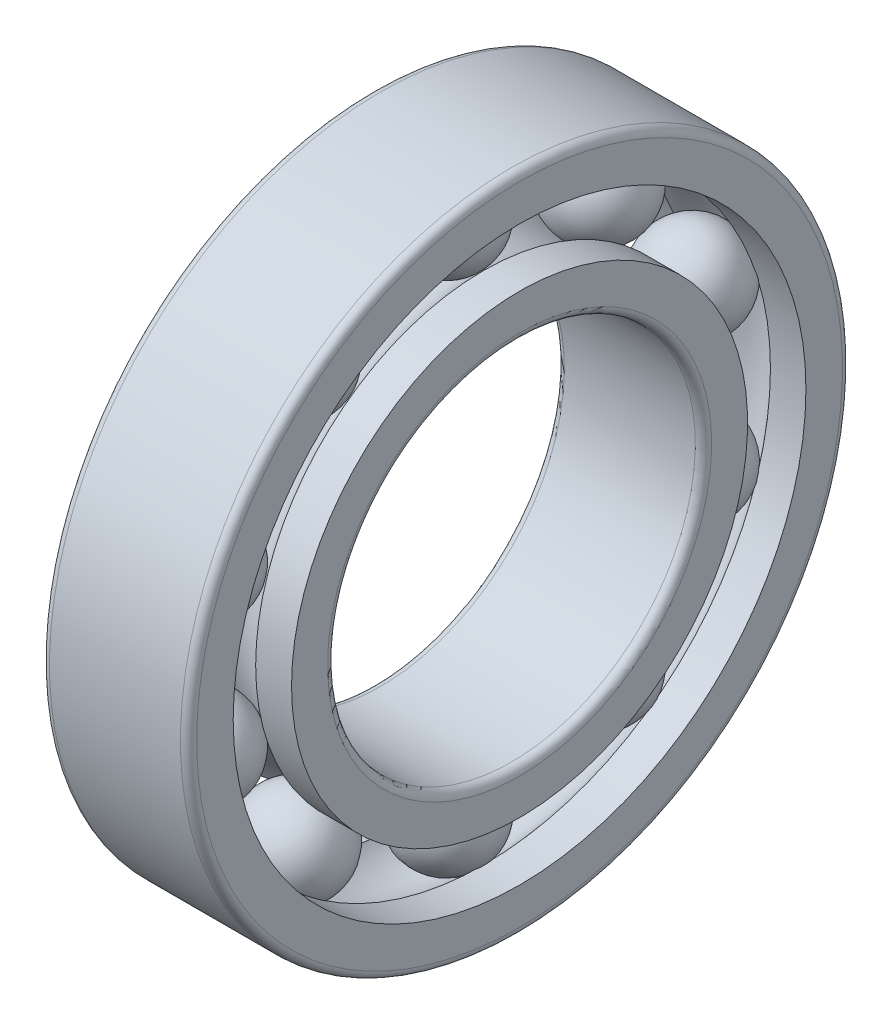
ISO-10303-21;
HEADER;
FILE_DESCRIPTION(('STEP AP214'),'2;1');
FILE_NAME('part.step','',(''),(''),'','','');
FILE_SCHEMA(('AUTOMOTIVE_DESIGN { 1 0 10303 214 1 1 1 1 }'));
ENDSEC;
DATA;
#1=APPLICATION_CONTEXT('core data for automotive mechanical design processes');
#2=APPLICATION_PROTOCOL_DEFINITION('international standard','automotive_design',2000,#1);
#3=PRODUCT_CONTEXT('',#1,'mechanical');
#4=PRODUCT('Part','Part','',(#3));
#5=PRODUCT_RELATED_PRODUCT_CATEGORY('part','',(#4));
#6=PRODUCT_DEFINITION_FORMATION('','',#4);
#7=PRODUCT_DEFINITION_CONTEXT('part definition',#1,'design');
#8=PRODUCT_DEFINITION('design','',#6,#7);
#9=PRODUCT_DEFINITION_SHAPE('','',#8);
#10=(LENGTH_UNIT() NAMED_UNIT(*) SI_UNIT(.MILLI.,.METRE.));
#11=(NAMED_UNIT(*) PLANE_ANGLE_UNIT() SI_UNIT($,.RADIAN.));
#12=(NAMED_UNIT(*) SI_UNIT($,.STERADIAN.) SOLID_ANGLE_UNIT());
#13=UNCERTAINTY_MEASURE_WITH_UNIT(LENGTH_MEASURE(1.E-05),#10,'distance_accuracy_value','');
#14=(GEOMETRIC_REPRESENTATION_CONTEXT(3) GLOBAL_UNCERTAINTY_ASSIGNED_CONTEXT((#13)) GLOBAL_UNIT_ASSIGNED_CONTEXT((#10,
#11,#12)) REPRESENTATION_CONTEXT('',''));
#15=CARTESIAN_POINT('',(0.,0.,0.));
#16=DIRECTION('',(0.,0.,1.));
#17=DIRECTION('',(1.,0.,0.));
#18=AXIS2_PLACEMENT_3D('',#15,#16,#17);
#19=CARTESIAN_POINT('',(10.,-10.8650375222232,-33.4391471129376));
#20=DIRECTION('',(0.689414425900797,0.536271774771845,0.486950031258784));
#21=DIRECTION('',(0.407744625601292,-0.842926175682675,0.351026754880939));
#22=AXIS2_PLACEMENT_3D('',#19,#20,#21);
#23=SPHERICAL_SURFACE('',#22,6.5);
#24=CARTESIAN_POINT('',(5.51880623164482,-14.3508040582402,-36.6043223161197));
#25=VERTEX_POINT('',#24);
#26=VERTEX_LOOP('',#25);
#27=FACE_BOUND('',#26,.T.);
#28=CARTESIAN_POINT('',(14.4811937683552,-7.37927098620621,-30.2739719097555));
#29=VERTEX_POINT('',#28);
#30=VERTEX_LOOP('',#29);
#31=FACE_BOUND('',#30,.T.);
#32=ADVANCED_FACE('P0_F16',(#27,#31),#23,.T.);
#33=CLOSED_SHELL('',(#32));
#34=MANIFOLD_SOLID_BREP('P0_B1',#33);
#35=CARTESIAN_POINT('',(10.,-28.4450375222232,-20.6665294706034));
#36=DIRECTION('',(0.0861185466508673,0.817785264653347,0.569043809243716));
#37=DIRECTION('',(-0.21949427876557,-0.541558086898072,0.811502988352158));
#38=AXIS2_PLACEMENT_3D('',#35,#36,#37);
#39=SPHERICAL_SURFACE('',#38,6.5);
#40=CARTESIAN_POINT('',(10.5597705532306,-23.1294333019764,-16.9677447105192));
#41=VERTEX_POINT('',#40);
#42=VERTEX_LOOP('',#41);
#43=FACE_BOUND('',#42,.T.);
#44=CARTESIAN_POINT('',(9.44022944676936,-33.76064174247,-24.3653142306876));
#45=VERTEX_POINT('',#44);
#46=VERTEX_LOOP('',#45);
#47=FACE_BOUND('',#46,.T.);
#48=ADVANCED_FACE('P1_F16',(#43,#47),#39,.T.);
#49=CLOSED_SHELL('',(#48));
#50=MANIFOLD_SOLID_BREP('P1_B1',#49);
#51=CARTESIAN_POINT('',(10.,-35.16,0.));
#52=DIRECTION('',(0.0861185466508673,0.817785264653347,0.569043809243716));
#53=DIRECTION('',(-0.21949427876557,-0.541558086898072,0.811502988352158));
#54=AXIS2_PLACEMENT_3D('',#51,#52,#53);
#55=SPHERICAL_SURFACE('',#54,6.5);
#56=CARTESIAN_POINT('',(9.44022944676936,-40.4756042202468,-3.69878476008415));
#57=VERTEX_POINT('',#56);
#58=VERTEX_LOOP('',#57);
#59=FACE_BOUND('',#58,.T.);
#60=CARTESIAN_POINT('',(10.5597705532306,-29.8443957797532,3.69878476008415));
#61=VERTEX_POINT('',#60);
#62=VERTEX_LOOP('',#61);
#63=FACE_BOUND('',#62,.T.);
#64=ADVANCED_FACE('P2_F16',(#59,#63),#55,.T.);
#65=CLOSED_SHELL('',(#64));
#66=MANIFOLD_SOLID_BREP('P2_B1',#65);
#67=CARTESIAN_POINT('',(10.,-28.4450375222231,20.6665294706034));
#68=DIRECTION('',(0.0861185466508673,0.817785264653347,0.569043809243716));
#69=DIRECTION('',(-0.21949427876557,-0.541558086898072,0.811502988352158));
#70=AXIS2_PLACEMENT_3D('',#67,#68,#69);
#71=SPHERICAL_SURFACE('',#70,6.5);
#72=CARTESIAN_POINT('',(9.44022944676936,-33.7606417424699,16.9677447105192));
#73=VERTEX_POINT('',#72);
#74=VERTEX_LOOP('',#73);
#75=FACE_BOUND('',#74,.T.);
#76=CARTESIAN_POINT('',(10.5597705532306,-23.1294333019763,24.3653142306876));
#77=VERTEX_POINT('',#76);
#78=VERTEX_LOOP('',#77);
#79=FACE_BOUND('',#78,.T.);
#80=ADVANCED_FACE('P3_F15',(#75,#79),#71,.T.);
#81=CLOSED_SHELL('',(#80));
#82=MANIFOLD_SOLID_BREP('P3_B1',#81);
#83=CARTESIAN_POINT('',(10.,-10.8650375222231,33.4391471129376));
#84=DIRECTION('',(0.0861185466508673,0.817785264653347,0.569043809243716));
#85=DIRECTION('',(-0.21949427876557,-0.541558086898072,0.811502988352158));
#86=AXIS2_PLACEMENT_3D('',#83,#84,#85);
#87=SPHERICAL_SURFACE('',#86,6.5);
#88=CARTESIAN_POINT('',(9.44022944676936,-16.1806417424699,29.7403623528534));
#89=VERTEX_POINT('',#88);
#90=VERTEX_LOOP('',#89);
#91=FACE_BOUND('',#90,.T.);
#92=CARTESIAN_POINT('',(10.5597705532306,-5.54943330197634,37.1379318730217));
#93=VERTEX_POINT('',#92);
#94=VERTEX_LOOP('',#93);
#95=FACE_BOUND('',#94,.T.);
#96=ADVANCED_FACE('P4_F16',(#91,#95),#87,.T.);
#97=CLOSED_SHELL('',(#96));
#98=MANIFOLD_SOLID_BREP('P4_B1',#97);
#99=CARTESIAN_POINT('',(10.,10.8650375222232,33.4391471129376));
#100=DIRECTION('',(0.0861185466508673,0.817785264653347,0.569043809243716));
#101=DIRECTION('',(-0.21949427876557,-0.541558086898072,0.811502988352158));
#102=AXIS2_PLACEMENT_3D('',#99,#100,#101);
#103=SPHERICAL_SURFACE('',#102,6.5);
#104=CARTESIAN_POINT('',(9.44022944676936,5.54943330197645,29.7403623528534));
#105=VERTEX_POINT('',#104);
#106=VERTEX_LOOP('',#105);
#107=FACE_BOUND('',#106,.T.);
#108=CARTESIAN_POINT('',(10.5597705532306,16.18064174247,37.1379318730217));
#109=VERTEX_POINT('',#108);
#110=VERTEX_LOOP('',#109);
#111=FACE_BOUND('',#110,.T.);
#112=ADVANCED_FACE('P5_F16',(#107,#111),#103,.T.);
#113=CLOSED_SHELL('',(#112));
#114=MANIFOLD_SOLID_BREP('P5_B1',#113);
#115=CARTESIAN_POINT('',(10.,28.4450375222231,20.6665294706034));
#116=DIRECTION('',(0.0861185466508673,0.817785264653347,0.569043809243716));
#117=DIRECTION('',(-0.21949427876557,-0.541558086898072,0.811502988352158));
#118=AXIS2_PLACEMENT_3D('',#115,#116,#117);
#119=SPHERICAL_SURFACE('',#118,6.5);
#120=CARTESIAN_POINT('',(9.44022944676936,23.1294333019763,16.9677447105192));
#121=VERTEX_POINT('',#120);
#122=VERTEX_LOOP('',#121);
#123=FACE_BOUND('',#122,.T.);
#124=CARTESIAN_POINT('',(10.5597705532306,33.7606417424699,24.3653142306876));
#125=VERTEX_POINT('',#124);
#126=VERTEX_LOOP('',#125);
#127=FACE_BOUND('',#126,.T.);
#128=ADVANCED_FACE('P6_F16',(#123,#127),#119,.T.);
#129=CLOSED_SHELL('',(#128));
#130=MANIFOLD_SOLID_BREP('P6_B1',#129);
#131=CARTESIAN_POINT('',(10.,35.16,0.));
#132=DIRECTION('',(0.0861185466508673,0.817785264653347,0.569043809243716));
#133=DIRECTION('',(-0.21949427876557,-0.541558086898072,0.811502988352158));
#134=AXIS2_PLACEMENT_3D('',#131,#132,#133);
#135=SPHERICAL_SURFACE('',#134,6.5);
#136=CARTESIAN_POINT('',(10.5597705532306,40.4756042202468,3.69878476008415));
#137=VERTEX_POINT('',#136);
#138=VERTEX_LOOP('',#137);
#139=FACE_BOUND('',#138,.T.);
#140=CARTESIAN_POINT('',(9.44022944676936,29.8443957797532,-3.69878476008415));
#141=VERTEX_POINT('',#140);
#142=VERTEX_LOOP('',#141);
#143=FACE_BOUND('',#142,.T.);
#144=ADVANCED_FACE('P7_F16',(#139,#143),#135,.T.);
#145=CLOSED_SHELL('',(#144));
#146=MANIFOLD_SOLID_BREP('P7_B1',#145);
#147=CARTESIAN_POINT('',(10.,0.,0.));
#148=DIRECTION('',(-1.,0.,0.));
#149=DIRECTION('',(0.,0.,1.));
#150=AXIS2_PLACEMENT_3D('',#147,#148,#149);
#151=CYLINDRICAL_SURFACE('',#150,45.);
#152=CARTESIAN_POINT('',(1.1,0.,0.));
#153=DIRECTION('',(1.,0.,0.));
#154=DIRECTION('',(0.,1.,0.));
#155=AXIS2_PLACEMENT_3D('',#152,#153,#154);
#156=CIRCLE('',#155,45.);
#157=CARTESIAN_POINT('',(1.1,45.,0.));
#158=VERTEX_POINT('',#157);
#159=EDGE_CURVE('P8_E77',#158,#158,#156,.F.);
#160=ORIENTED_EDGE('',*,*,#159,.F.);
#161=EDGE_LOOP('',(#160));
#162=FACE_BOUND('',#161,.T.);
#163=CARTESIAN_POINT('',(18.9,0.,0.));
#164=DIRECTION('',(1.,0.,0.));
#165=DIRECTION('',(0.,1.,0.));
#166=AXIS2_PLACEMENT_3D('',#163,#164,#165);
#167=CIRCLE('',#166,45.);
#168=CARTESIAN_POINT('',(18.9,45.,0.));
#169=VERTEX_POINT('',#168);
#170=EDGE_CURVE('P8_E73',#169,#169,#167,.T.);
#171=ORIENTED_EDGE('',*,*,#170,.F.);
#172=EDGE_LOOP('',(#171));
#173=FACE_BOUND('',#172,.T.);
#174=ADVANCED_FACE('P8_F15',(#162,#173),#151,.T.);
#175=CARTESIAN_POINT('',(1.1,0.,0.));
#176=DIRECTION('',(1.,0.,0.));
#177=DIRECTION('',(0.,1.,0.));
#178=AXIS2_PLACEMENT_3D('',#175,#176,#177);
#179=TOROIDAL_SURFACE('',#178,43.9,1.1);
#180=CARTESIAN_POINT('',(0.,0.,0.));
#181=DIRECTION('',(1.,0.,0.));
#182=DIRECTION('',(0.,-1.,0.));
#183=AXIS2_PLACEMENT_3D('',#180,#181,#182);
#184=CIRCLE('',#183,43.9);
#185=CARTESIAN_POINT('',(0.,-43.9,0.));
#186=VERTEX_POINT('',#185);
#187=EDGE_CURVE('P8_E76',#186,#186,#184,.F.);
#188=ORIENTED_EDGE('',*,*,#187,.F.);
#189=EDGE_LOOP('',(#188));
#190=FACE_BOUND('',#189,.T.);
#191=ORIENTED_EDGE('',*,*,#159,.T.);
#192=EDGE_LOOP('',(#191));
#193=FACE_BOUND('',#192,.T.);
#194=ADVANCED_FACE('P8_F91',(#190,#193),#179,.T.);
#195=CARTESIAN_POINT('',(18.9,0.,0.));
#196=DIRECTION('',(1.,0.,0.));
#197=DIRECTION('',(0.,1.,0.));
#198=AXIS2_PLACEMENT_3D('',#195,#196,#197);
#199=TOROIDAL_SURFACE('',#198,43.9,1.1);
#200=ORIENTED_EDGE('',*,*,#170,.T.);
#201=EDGE_LOOP('',(#200));
#202=FACE_BOUND('',#201,.T.);
#203=CARTESIAN_POINT('',(20.,0.,0.));
#204=DIRECTION('',(-1.,0.,0.));
#205=DIRECTION('',(0.,-1.,0.));
#206=AXIS2_PLACEMENT_3D('',#203,#204,#205);
#207=CIRCLE('',#206,43.9);
#208=CARTESIAN_POINT('',(20.,-43.9,0.));
#209=VERTEX_POINT('',#208);
#210=EDGE_CURVE('P8_E36',#209,#209,#207,.F.);
#211=ORIENTED_EDGE('',*,*,#210,.F.);
#212=EDGE_LOOP('',(#211));
#213=FACE_BOUND('',#212,.T.);
#214=ADVANCED_FACE('P8_F60',(#202,#213),#199,.T.);
#215=CARTESIAN_POINT('',(0.,0.,41.41500025));
#216=DIRECTION('',(-1.,0.,0.));
#217=DIRECTION('',(0.,0.,1.));
#218=AXIS2_PLACEMENT_3D('',#215,#216,#217);
#219=PLANE('',#218);
#220=CARTESIAN_POINT('',(0.,0.,0.));
#221=DIRECTION('',(-1.,0.,0.));
#222=DIRECTION('',(0.,0.,1.));
#223=AXIS2_PLACEMENT_3D('',#220,#221,#222);
#224=CIRCLE('',#223,38.9300005);
#225=CARTESIAN_POINT('',(0.,0.,38.9300005));
#226=VERTEX_POINT('',#225);
#227=EDGE_CURVE('P8_E18',#226,#226,#224,.F.);
#228=ORIENTED_EDGE('',*,*,#227,.T.);
#229=EDGE_LOOP('',(#228));
#230=FACE_BOUND('',#229,.T.);
#231=ORIENTED_EDGE('',*,*,#187,.T.);
#232=EDGE_LOOP('',(#231));
#233=FACE_BOUND('',#232,.T.);
#234=ADVANCED_FACE('P8_F54',(#230,#233),#219,.T.);
#235=CARTESIAN_POINT('',(20.,0.,41.41500025));
#236=DIRECTION('',(1.,0.,0.));
#237=DIRECTION('',(0.,0.,-1.));
#238=AXIS2_PLACEMENT_3D('',#235,#236,#237);
#239=PLANE('',#238);
#240=CARTESIAN_POINT('',(20.,0.,0.));
#241=DIRECTION('',(-1.,0.,0.));
#242=DIRECTION('',(0.,0.,1.));
#243=AXIS2_PLACEMENT_3D('',#240,#241,#242);
#244=CIRCLE('',#243,38.9300005);
#245=CARTESIAN_POINT('',(20.,0.,38.9300005));
#246=VERTEX_POINT('',#245);
#247=EDGE_CURVE('P8_E27',#246,#246,#244,.T.);
#248=ORIENTED_EDGE('',*,*,#247,.T.);
#249=EDGE_LOOP('',(#248));
#250=FACE_BOUND('',#249,.T.);
#251=ORIENTED_EDGE('',*,*,#210,.T.);
#252=EDGE_LOOP('',(#251));
#253=FACE_BOUND('',#252,.T.);
#254=ADVANCED_FACE('P8_F43',(#250,#253),#239,.T.);
#255=CARTESIAN_POINT('',(2.41131809263866,0.,0.));
#256=DIRECTION('',(-1.,0.,0.));
#257=DIRECTION('',(0.,0.,1.));
#258=AXIS2_PLACEMENT_3D('',#255,#256,#257);
#259=CYLINDRICAL_SURFACE('',#258,38.9300005);
#260=CARTESIAN_POINT('',(4.82263618527732,0.,0.));
#261=DIRECTION('',(1.,0.,0.));
#262=DIRECTION('',(0.,1.,0.));
#263=AXIS2_PLACEMENT_3D('',#260,#261,#262);
#264=CIRCLE('',#263,38.9300005);
#265=CARTESIAN_POINT('',(4.82263618527732,38.9300005,0.));
#266=VERTEX_POINT('',#265);
#267=EDGE_CURVE('P8_E22',#266,#266,#264,.T.);
#268=ORIENTED_EDGE('',*,*,#267,.T.);
#269=EDGE_LOOP('',(#268));
#270=FACE_BOUND('',#269,.T.);
#271=ORIENTED_EDGE('',*,*,#227,.F.);
#272=EDGE_LOOP('',(#271));
#273=FACE_BOUND('',#272,.T.);
#274=ADVANCED_FACE('P8_F53',(#270,#273),#259,.F.);
#275=CARTESIAN_POINT('',(17.5886819073613,0.,0.));
#276=DIRECTION('',(-1.,0.,0.));
#277=DIRECTION('',(0.,0.,1.));
#278=AXIS2_PLACEMENT_3D('',#275,#276,#277);
#279=CYLINDRICAL_SURFACE('',#278,38.9300005);
#280=CARTESIAN_POINT('',(15.1773638147227,0.,0.));
#281=DIRECTION('',(1.,0.,0.));
#282=DIRECTION('',(0.,1.,0.));
#283=AXIS2_PLACEMENT_3D('',#280,#281,#282);
#284=CIRCLE('',#283,38.9300005);
#285=CARTESIAN_POINT('',(15.1773638147227,38.9300005,0.));
#286=VERTEX_POINT('',#285);
#287=EDGE_CURVE('P8_E10',#286,#286,#284,.F.);
#288=ORIENTED_EDGE('',*,*,#287,.T.);
#289=EDGE_LOOP('',(#288));
#290=FACE_BOUND('',#289,.T.);
#291=ORIENTED_EDGE('',*,*,#247,.F.);
#292=EDGE_LOOP('',(#291));
#293=FACE_BOUND('',#292,.T.);
#294=ADVANCED_FACE('P8_F123',(#290,#293),#279,.F.);
#295=CARTESIAN_POINT('',(10.,0.,0.));
#296=DIRECTION('',(1.,0.,0.));
#297=DIRECTION('',(0.,1.,0.));
#298=AXIS2_PLACEMENT_3D('',#295,#296,#297);
#299=TOROIDAL_SURFACE('',#298,35.,6.5);
#300=ORIENTED_EDGE('',*,*,#287,.F.);
#301=EDGE_LOOP('',(#300));
#302=FACE_BOUND('',#301,.T.);
#303=ORIENTED_EDGE('',*,*,#267,.F.);
#304=EDGE_LOOP('',(#303));
#305=FACE_BOUND('',#304,.T.);
#306=ADVANCED_FACE('P8_F121',(#302,#305),#299,.F.);
#307=CLOSED_SHELL('',(#174,#194,#214,#234,#254,#274,#294,#306));
#308=MANIFOLD_SOLID_BREP('P8_B1',#307);
#309=CARTESIAN_POINT('',(10.,0.,0.));
#310=DIRECTION('',(-1.,0.,0.));
#311=DIRECTION('',(0.,0.,1.));
#312=AXIS2_PLACEMENT_3D('',#309,#310,#311);
#313=CYLINDRICAL_SURFACE('',#312,25.);
#314=CARTESIAN_POINT('',(1.1,0.,0.));
#315=DIRECTION('',(1.,0.,0.));
#316=DIRECTION('',(0.,1.,0.));
#317=AXIS2_PLACEMENT_3D('',#314,#315,#316);
#318=CIRCLE('',#317,25.);
#319=CARTESIAN_POINT('',(1.1,25.,0.));
#320=VERTEX_POINT('',#319);
#321=EDGE_CURVE('P9_E69',#320,#320,#318,.T.);
#322=ORIENTED_EDGE('',*,*,#321,.F.);
#323=EDGE_LOOP('',(#322));
#324=FACE_BOUND('',#323,.T.);
#325=CARTESIAN_POINT('',(18.9,0.,0.));
#326=DIRECTION('',(1.,0.,0.));
#327=DIRECTION('',(0.,1.,0.));
#328=AXIS2_PLACEMENT_3D('',#325,#326,#327);
#329=CIRCLE('',#328,25.);
#330=CARTESIAN_POINT('',(18.9,25.,0.));
#331=VERTEX_POINT('',#330);
#332=EDGE_CURVE('P9_E66',#331,#331,#329,.F.);
#333=ORIENTED_EDGE('',*,*,#332,.F.);
#334=EDGE_LOOP('',(#333));
#335=FACE_BOUND('',#334,.T.);
#336=ADVANCED_FACE('P9_F15',(#324,#335),#313,.F.);
#337=CARTESIAN_POINT('',(1.1,0.,0.));
#338=DIRECTION('',(1.,0.,0.));
#339=DIRECTION('',(0.,1.,0.));
#340=AXIS2_PLACEMENT_3D('',#337,#338,#339);
#341=TOROIDAL_SURFACE('',#340,26.1,1.1);
#342=ORIENTED_EDGE('',*,*,#321,.T.);
#343=EDGE_LOOP('',(#342));
#344=FACE_BOUND('',#343,.T.);
#345=CARTESIAN_POINT('',(0.,0.,0.));
#346=DIRECTION('',(-1.,0.,0.));
#347=DIRECTION('',(0.,-1.,0.));
#348=AXIS2_PLACEMENT_3D('',#345,#346,#347);
#349=CIRCLE('',#348,26.1);
#350=CARTESIAN_POINT('',(0.,-26.1,0.));
#351=VERTEX_POINT('',#350);
#352=EDGE_CURVE('P9_E39',#351,#351,#349,.F.);
#353=ORIENTED_EDGE('',*,*,#352,.F.);
#354=EDGE_LOOP('',(#353));
#355=FACE_BOUND('',#354,.T.);
#356=ADVANCED_FACE('P9_F59',(#344,#355),#341,.T.);
#357=CARTESIAN_POINT('',(18.9,0.,0.));
#358=DIRECTION('',(1.,0.,0.));
#359=DIRECTION('',(0.,1.,0.));
#360=AXIS2_PLACEMENT_3D('',#357,#358,#359);
#361=TOROIDAL_SURFACE('',#360,26.1,1.1);
#362=CARTESIAN_POINT('',(20.,0.,0.));
#363=DIRECTION('',(1.,0.,0.));
#364=DIRECTION('',(0.,-1.,0.));
#365=AXIS2_PLACEMENT_3D('',#362,#363,#364);
#366=CIRCLE('',#365,26.1);
#367=CARTESIAN_POINT('',(20.,-26.1,0.));
#368=VERTEX_POINT('',#367);
#369=EDGE_CURVE('P9_E72',#368,#368,#366,.F.);
#370=ORIENTED_EDGE('',*,*,#369,.F.);
#371=EDGE_LOOP('',(#370));
#372=FACE_BOUND('',#371,.T.);
#373=ORIENTED_EDGE('',*,*,#332,.T.);
#374=EDGE_LOOP('',(#373));
#375=FACE_BOUND('',#374,.T.);
#376=ADVANCED_FACE('P9_F54',(#372,#375),#361,.T.);
#377=CARTESIAN_POINT('',(0.,0.,28.55));
#378=DIRECTION('',(-1.,0.,0.));
#379=DIRECTION('',(0.,0.,1.));
#380=AXIS2_PLACEMENT_3D('',#377,#378,#379);
#381=PLANE('',#380);
#382=ORIENTED_EDGE('',*,*,#352,.T.);
#383=EDGE_LOOP('',(#382));
#384=FACE_BOUND('',#383,.T.);
#385=CARTESIAN_POINT('',(0.,0.,0.));
#386=DIRECTION('',(-1.,0.,0.));
#387=DIRECTION('',(0.,0.,1.));
#388=AXIS2_PLACEMENT_3D('',#385,#386,#387);
#389=CIRCLE('',#388,31.);
#390=CARTESIAN_POINT('',(0.,0.,31.));
#391=VERTEX_POINT('',#390);
#392=EDGE_CURVE('P9_E18',#391,#391,#389,.F.);
#393=ORIENTED_EDGE('',*,*,#392,.F.);
#394=EDGE_LOOP('',(#393));
#395=FACE_BOUND('',#394,.T.);
#396=ADVANCED_FACE('P9_F44',(#384,#395),#381,.T.);
#397=CARTESIAN_POINT('',(20.,0.,28.55));
#398=DIRECTION('',(1.,0.,0.));
#399=DIRECTION('',(0.,0.,-1.));
#400=AXIS2_PLACEMENT_3D('',#397,#398,#399);
#401=PLANE('',#400);
#402=ORIENTED_EDGE('',*,*,#369,.T.);
#403=EDGE_LOOP('',(#402));
#404=FACE_BOUND('',#403,.T.);
#405=CARTESIAN_POINT('',(20.,0.,0.));
#406=DIRECTION('',(-1.,0.,0.));
#407=DIRECTION('',(0.,0.,1.));
#408=AXIS2_PLACEMENT_3D('',#405,#406,#407);
#409=CIRCLE('',#408,31.);
#410=CARTESIAN_POINT('',(20.,0.,31.));
#411=VERTEX_POINT('',#410);
#412=EDGE_CURVE('P9_E27',#411,#411,#409,.T.);
#413=ORIENTED_EDGE('',*,*,#412,.F.);
#414=EDGE_LOOP('',(#413));
#415=FACE_BOUND('',#414,.T.);
#416=ADVANCED_FACE('P9_F53',(#404,#415),#401,.T.);
#417=CARTESIAN_POINT('',(2.4382623085101,0.,0.));
#418=DIRECTION('',(-1.,0.,0.));
#419=DIRECTION('',(0.,0.,1.));
#420=AXIS2_PLACEMENT_3D('',#417,#418,#419);
#421=CYLINDRICAL_SURFACE('',#420,31.);
#422=ORIENTED_EDGE('',*,*,#392,.T.);
#423=EDGE_LOOP('',(#422));
#424=FACE_BOUND('',#423,.T.);
#425=CARTESIAN_POINT('',(4.8765246170202,0.,0.));
#426=DIRECTION('',(1.,0.,0.));
#427=DIRECTION('',(0.,1.,0.));
#428=AXIS2_PLACEMENT_3D('',#425,#426,#427);
#429=CIRCLE('',#428,31.);
#430=CARTESIAN_POINT('',(4.8765246170202,31.,0.));
#431=VERTEX_POINT('',#430);
#432=EDGE_CURVE('P9_E22',#431,#431,#429,.F.);
#433=ORIENTED_EDGE('',*,*,#432,.T.);
#434=EDGE_LOOP('',(#433));
#435=FACE_BOUND('',#434,.T.);
#436=ADVANCED_FACE('P9_F110',(#424,#435),#421,.T.);
#437=CARTESIAN_POINT('',(17.5617376914899,0.,0.));
#438=DIRECTION('',(-1.,0.,0.));
#439=DIRECTION('',(0.,0.,1.));
#440=AXIS2_PLACEMENT_3D('',#437,#438,#439);
#441=CYLINDRICAL_SURFACE('',#440,31.);
#442=ORIENTED_EDGE('',*,*,#412,.T.);
#443=EDGE_LOOP('',(#442));
#444=FACE_BOUND('',#443,.T.);
#445=CARTESIAN_POINT('',(15.1234753829798,0.,0.));
#446=DIRECTION('',(1.,0.,0.));
#447=DIRECTION('',(0.,1.,0.));
#448=AXIS2_PLACEMENT_3D('',#445,#446,#447);
#449=CIRCLE('',#448,31.);
#450=CARTESIAN_POINT('',(15.1234753829798,31.,0.));
#451=VERTEX_POINT('',#450);
#452=EDGE_CURVE('P9_E10',#451,#451,#449,.T.);
#453=ORIENTED_EDGE('',*,*,#452,.T.);
#454=EDGE_LOOP('',(#453));
#455=FACE_BOUND('',#454,.T.);
#456=ADVANCED_FACE('P9_F107',(#444,#455),#441,.T.);
#457=CARTESIAN_POINT('',(10.,0.,0.));
#458=DIRECTION('',(1.,0.,0.));
#459=DIRECTION('',(0.,1.,0.));
#460=AXIS2_PLACEMENT_3D('',#457,#458,#459);
#461=TOROIDAL_SURFACE('',#460,35.,6.5);
#462=ORIENTED_EDGE('',*,*,#452,.F.);
#463=EDGE_LOOP('',(#462));
#464=FACE_BOUND('',#463,.T.);
#465=ORIENTED_EDGE('',*,*,#432,.F.);
#466=EDGE_LOOP('',(#465));
#467=FACE_BOUND('',#466,.T.);
#468=ADVANCED_FACE('P9_F104',(#464,#467),#461,.F.);
#469=CLOSED_SHELL('',(#336,#356,#376,#396,#416,#436,#456,#468));
#470=MANIFOLD_SOLID_BREP('P9_B1',#469);
#471=CARTESIAN_POINT('',(10.,28.4450375222231,-20.6665294706034));
#472=DIRECTION('',(0.689414425900797,0.536271774771845,0.486950031258784));
#473=DIRECTION('',(0.407744625601292,-0.842926175682675,0.351026754880938));
#474=AXIS2_PLACEMENT_3D('',#471,#472,#473);
#475=SPHERICAL_SURFACE('',#474,6.5);
#476=CARTESIAN_POINT('',(14.4811937683552,31.9308040582401,-17.5013542674213));
#477=VERTEX_POINT('',#476);
#478=VERTEX_LOOP('',#477);
#479=FACE_BOUND('',#478,.T.);
#480=CARTESIAN_POINT('',(5.51880623164482,24.9592709862061,-23.8317046737855));
#481=VERTEX_POINT('',#480);
#482=VERTEX_LOOP('',#481);
#483=FACE_BOUND('',#482,.T.);
#484=ADVANCED_FACE('P10_F16',(#479,#483),#475,.T.);
#485=CLOSED_SHELL('',(#484));
#486=MANIFOLD_SOLID_BREP('P10_B1',#485);
#487=CARTESIAN_POINT('',(10.,10.8650375222231,-33.4391471129376));
#488=DIRECTION('',(0.689414425900797,0.536271774771845,0.486950031258784));
#489=DIRECTION('',(0.407744625601292,-0.842926175682675,0.351026754880939));
#490=AXIS2_PLACEMENT_3D('',#487,#488,#489);
#491=SPHERICAL_SURFACE('',#490,6.5);
#492=CARTESIAN_POINT('',(5.51880623164482,7.37927098620611,-36.6043223161197));
#493=VERTEX_POINT('',#492);
#494=VERTEX_LOOP('',#493);
#495=FACE_BOUND('',#494,.T.);
#496=CARTESIAN_POINT('',(14.4811937683552,14.3508040582401,-30.2739719097555));
#497=VERTEX_POINT('',#496);
#498=VERTEX_LOOP('',#497);
#499=FACE_BOUND('',#498,.T.);
#500=ADVANCED_FACE('P11_F15',(#495,#499),#491,.T.);
#501=CLOSED_SHELL('',(#500));
#502=MANIFOLD_SOLID_BREP('P11_B1',#501);
#503=ADVANCED_BREP_SHAPE_REPRESENTATION('',(#18,#34,#50,#66,#82,#98,#114,#130,#146,#308,#470,
#486,#502),#14);
#504=SHAPE_DEFINITION_REPRESENTATION(#9,#503);
ENDSEC;
END-ISO-10303-21;
